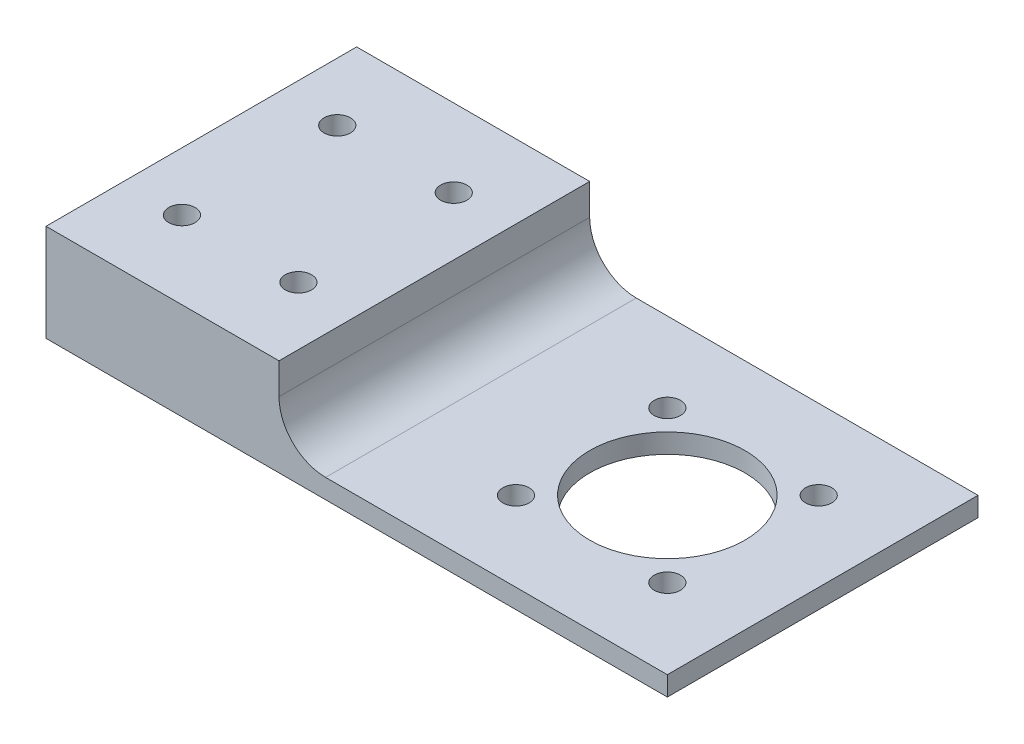
ISO-10303-21;
HEADER;
FILE_DESCRIPTION(('STEP AP214'),'2;1');
FILE_NAME('part.step','',(''),(''),'','','');
FILE_SCHEMA(('AUTOMOTIVE_DESIGN { 1 0 10303 214 1 1 1 1 }'));
ENDSEC;
DATA;
#1=APPLICATION_CONTEXT('core data for automotive mechanical design processes');
#2=APPLICATION_PROTOCOL_DEFINITION('international standard','automotive_design',2000,#1);
#3=PRODUCT_CONTEXT('',#1,'mechanical');
#4=PRODUCT('Part','Part','',(#3));
#5=PRODUCT_RELATED_PRODUCT_CATEGORY('part','',(#4));
#6=PRODUCT_DEFINITION_FORMATION('','',#4);
#7=PRODUCT_DEFINITION_CONTEXT('part definition',#1,'design');
#8=PRODUCT_DEFINITION('design','',#6,#7);
#9=PRODUCT_DEFINITION_SHAPE('','',#8);
#10=(LENGTH_UNIT() NAMED_UNIT(*) SI_UNIT(.MILLI.,.METRE.));
#11=(NAMED_UNIT(*) PLANE_ANGLE_UNIT() SI_UNIT($,.RADIAN.));
#12=(NAMED_UNIT(*) SI_UNIT($,.STERADIAN.) SOLID_ANGLE_UNIT());
#13=UNCERTAINTY_MEASURE_WITH_UNIT(LENGTH_MEASURE(1.E-05),#10,'distance_accuracy_value','');
#14=(GEOMETRIC_REPRESENTATION_CONTEXT(3) GLOBAL_UNCERTAINTY_ASSIGNED_CONTEXT((#13)) GLOBAL_UNIT_ASSIGNED_CONTEXT((#10,
#11,#12)) REPRESENTATION_CONTEXT('',''));
#15=CARTESIAN_POINT('',(0.,0.,0.));
#16=DIRECTION('',(0.,0.,1.));
#17=DIRECTION('',(1.,0.,0.));
#18=AXIS2_PLACEMENT_3D('',#15,#16,#17);
#19=CARTESIAN_POINT('',(0.,3.175,0.));
#20=DIRECTION('',(0.,-1.,0.));
#21=DIRECTION('',(0.,0.,-1.));
#22=AXIS2_PLACEMENT_3D('',#19,#20,#21);
#23=PLANE('',#22);
#24=CARTESIAN_POINT('',(38.1,3.175,0.));
#25=DIRECTION('',(0.,1.,0.));
#26=DIRECTION('',(0.,0.,1.));
#27=AXIS2_PLACEMENT_3D('',#24,#25,#26);
#28=CIRCLE('',#27,12.7);
#29=CARTESIAN_POINT('',(38.1,3.175,12.7));
#30=VERTEX_POINT('',#29);
#31=EDGE_CURVE('E316',#30,#30,#28,.T.);
#32=ORIENTED_EDGE('',*,*,#31,.F.);
#33=EDGE_LOOP('',(#32));
#34=FACE_BOUND('',#33,.T.);
#35=CARTESIAN_POINT('',(50.4743686707638,3.175,-12.3743686707636));
#36=DIRECTION('',(0.,1.,0.));
#37=DIRECTION('',(0.,0.,1.));
#38=AXIS2_PLACEMENT_3D('',#35,#36,#37);
#39=CIRCLE('',#38,2.15265);
#40=CARTESIAN_POINT('',(50.4743686707638,3.175,-10.2217186707636));
#41=VERTEX_POINT('',#40);
#42=EDGE_CURVE('E294',#41,#41,#39,.T.);
#43=ORIENTED_EDGE('',*,*,#42,.F.);
#44=EDGE_LOOP('',(#43));
#45=FACE_BOUND('',#44,.T.);
#46=CARTESIAN_POINT('',(25.7256313292346,3.175,12.3743686707654));
#47=DIRECTION('',(0.,1.,0.));
#48=DIRECTION('',(0.,0.,1.));
#49=AXIS2_PLACEMENT_3D('',#46,#47,#48);
#50=CIRCLE('',#49,2.15265);
#51=CARTESIAN_POINT('',(25.7256313292346,3.175,14.5270186707654));
#52=VERTEX_POINT('',#51);
#53=EDGE_CURVE('E289',#52,#52,#50,.T.);
#54=ORIENTED_EDGE('',*,*,#53,.F.);
#55=EDGE_LOOP('',(#54));
#56=FACE_BOUND('',#55,.T.);
#57=CARTESIAN_POINT('',(25.7256313292344,3.175,-12.3743686707635));
#58=DIRECTION('',(0.,1.,0.));
#59=DIRECTION('',(0.,0.,1.));
#60=AXIS2_PLACEMENT_3D('',#57,#58,#59);
#61=CIRCLE('',#60,2.15265);
#62=CARTESIAN_POINT('',(25.7256313292344,3.175,-10.2217186707635));
#63=VERTEX_POINT('',#62);
#64=EDGE_CURVE('E310',#63,#63,#61,.T.);
#65=ORIENTED_EDGE('',*,*,#64,.F.);
#66=EDGE_LOOP('',(#65));
#67=FACE_BOUND('',#66,.T.);
#68=CARTESIAN_POINT('',(50.4743686707642,3.175,12.374368670765));
#69=DIRECTION('',(0.,1.,0.));
#70=DIRECTION('',(0.,0.,1.));
#71=AXIS2_PLACEMENT_3D('',#68,#69,#70);
#72=CIRCLE('',#71,2.15265);
#73=CARTESIAN_POINT('',(50.4743686707642,3.175,14.527018670765));
#74=VERTEX_POINT('',#73);
#75=EDGE_CURVE('E118',#74,#74,#72,.T.);
#76=ORIENTED_EDGE('',*,*,#75,.F.);
#77=EDGE_LOOP('',(#76));
#78=FACE_BOUND('',#77,.T.);
#79=DIRECTION('',(-1.,0.,0.));
#80=VECTOR('',#79,1.);
#81=CARTESIAN_POINT('',(-38.1,3.175,-25.4));
#82=LINE('',#81,#80);
#83=CARTESIAN_POINT('',(63.5,3.175,-25.4));
#84=VERTEX_POINT('',#83);
#85=CARTESIAN_POINT('',(7.61999999999999,3.175,-25.4));
#86=VERTEX_POINT('',#85);
#87=EDGE_CURVE('E127',#84,#86,#82,.T.);
#88=ORIENTED_EDGE('',*,*,#87,.T.);
#89=DIRECTION('',(0.,0.,-1.));
#90=VECTOR('',#89,1.);
#91=CARTESIAN_POINT('',(7.62,3.175,25.4));
#92=LINE('',#91,#90);
#93=CARTESIAN_POINT('',(7.62,3.175,25.4));
#94=VERTEX_POINT('',#93);
#95=EDGE_CURVE('E53',#86,#94,#92,.F.);
#96=ORIENTED_EDGE('',*,*,#95,.T.);
#97=DIRECTION('',(1.,0.,0.));
#98=VECTOR('',#97,1.);
#99=CARTESIAN_POINT('',(-38.1,3.175,25.4));
#100=LINE('',#99,#98);
#101=CARTESIAN_POINT('',(63.5,3.175,25.4));
#102=VERTEX_POINT('',#101);
#103=EDGE_CURVE('E129',#94,#102,#100,.T.);
#104=ORIENTED_EDGE('',*,*,#103,.T.);
#105=DIRECTION('',(0.,0.,-1.));
#106=VECTOR('',#105,1.);
#107=CARTESIAN_POINT('',(63.5,3.175,-25.4));
#108=LINE('',#107,#106);
#109=EDGE_CURVE('E132',#102,#84,#108,.T.);
#110=ORIENTED_EDGE('',*,*,#109,.T.);
#111=EDGE_LOOP('',(#88,#96,#104,#110));
#112=FACE_BOUND('',#111,.T.);
#113=ADVANCED_FACE('F32',(#34,#45,#56,#67,#78,#112),#23,.F.);
#114=CARTESIAN_POINT('',(-38.1,3.175,-25.4));
#115=DIRECTION('',(1.,0.,0.));
#116=DIRECTION('',(0.,0.,-1.));
#117=AXIS2_PLACEMENT_3D('',#114,#115,#116);
#118=PLANE('',#117);
#119=DIRECTION('',(0.,0.,1.));
#120=VECTOR('',#119,1.);
#121=CARTESIAN_POINT('',(-38.1,0.,-25.4));
#122=LINE('',#121,#120);
#123=CARTESIAN_POINT('',(-38.1,0.,-25.4));
#124=VERTEX_POINT('',#123);
#125=CARTESIAN_POINT('',(-38.1,0.,25.4));
#126=VERTEX_POINT('',#125);
#127=EDGE_CURVE('E97',#124,#126,#122,.T.);
#128=ORIENTED_EDGE('',*,*,#127,.T.);
#129=DIRECTION('',(0.,-1.,0.));
#130=VECTOR('',#129,1.);
#131=CARTESIAN_POINT('',(-38.1,3.175,25.4));
#132=LINE('',#131,#130);
#133=CARTESIAN_POINT('',(-38.1,15.875,25.4));
#134=VERTEX_POINT('',#133);
#135=EDGE_CURVE('E90',#134,#126,#132,.T.);
#136=ORIENTED_EDGE('',*,*,#135,.F.);
#137=DIRECTION('',(0.,0.,1.));
#138=VECTOR('',#137,1.);
#139=CARTESIAN_POINT('',(-38.1,15.875,-25.4));
#140=LINE('',#139,#138);
#141=CARTESIAN_POINT('',(-38.1,15.875,-25.4));
#142=VERTEX_POINT('',#141);
#143=EDGE_CURVE('E95',#142,#134,#140,.T.);
#144=ORIENTED_EDGE('',*,*,#143,.F.);
#145=DIRECTION('',(0.,-1.,0.));
#146=VECTOR('',#145,1.);
#147=CARTESIAN_POINT('',(-38.1,3.175,-25.4));
#148=LINE('',#147,#146);
#149=EDGE_CURVE('E99',#142,#124,#148,.T.);
#150=ORIENTED_EDGE('',*,*,#149,.T.);
#151=EDGE_LOOP('',(#128,#136,#144,#150));
#152=FACE_BOUND('',#151,.T.);
#153=ADVANCED_FACE('F92',(#152),#118,.F.);
#154=CARTESIAN_POINT('',(63.5,3.175,25.4));
#155=DIRECTION('',(0.,0.,-1.));
#156=DIRECTION('',(-1.,0.,0.));
#157=AXIS2_PLACEMENT_3D('',#154,#155,#156);
#158=PLANE('',#157);
#159=DIRECTION('',(1.,0.,0.));
#160=VECTOR('',#159,1.);
#161=CARTESIAN_POINT('',(63.5,0.,25.4));
#162=LINE('',#161,#160);
#163=CARTESIAN_POINT('',(63.5,0.,25.4));
#164=VERTEX_POINT('',#163);
#165=EDGE_CURVE('E137',#126,#164,#162,.T.);
#166=ORIENTED_EDGE('',*,*,#165,.T.);
#167=DIRECTION('',(0.,-1.,0.));
#168=VECTOR('',#167,1.);
#169=CARTESIAN_POINT('',(63.5,3.175,25.4));
#170=LINE('',#169,#168);
#171=EDGE_CURVE('E100',#102,#164,#170,.T.);
#172=ORIENTED_EDGE('',*,*,#171,.F.);
#173=ORIENTED_EDGE('',*,*,#103,.F.);
#174=CARTESIAN_POINT('',(7.62,10.795,25.4));
#175=DIRECTION('',(0.,0.,-1.));
#176=DIRECTION('',(-1.,0.,0.));
#177=AXIS2_PLACEMENT_3D('',#174,#175,#176);
#178=CIRCLE('',#177,7.62);
#179=CARTESIAN_POINT('',(0.,10.795,25.4));
#180=VERTEX_POINT('',#179);
#181=EDGE_CURVE('E11',#94,#180,#178,.T.);
#182=ORIENTED_EDGE('',*,*,#181,.T.);
#183=DIRECTION('',(0.,-1.,0.));
#184=VECTOR('',#183,1.);
#185=CARTESIAN_POINT('',(0.,15.875,25.4));
#186=LINE('',#185,#184);
#187=CARTESIAN_POINT('',(0.,15.875,25.4));
#188=VERTEX_POINT('',#187);
#189=EDGE_CURVE('E106',#188,#180,#186,.T.);
#190=ORIENTED_EDGE('',*,*,#189,.F.);
#191=DIRECTION('',(1.,0.,0.));
#192=VECTOR('',#191,1.);
#193=CARTESIAN_POINT('',(-38.1,15.875,25.4));
#194=LINE('',#193,#192);
#195=EDGE_CURVE('E103',#134,#188,#194,.T.);
#196=ORIENTED_EDGE('',*,*,#195,.F.);
#197=ORIENTED_EDGE('',*,*,#135,.T.);
#198=EDGE_LOOP('',(#166,#172,#173,#182,#190,#196,#197));
#199=FACE_BOUND('',#198,.T.);
#200=ADVANCED_FACE('F104',(#199),#158,.F.);
#201=CARTESIAN_POINT('',(63.5,3.175,-25.4));
#202=DIRECTION('',(-1.,0.,0.));
#203=DIRECTION('',(0.,0.,1.));
#204=AXIS2_PLACEMENT_3D('',#201,#202,#203);
#205=PLANE('',#204);
#206=DIRECTION('',(0.,0.,-1.));
#207=VECTOR('',#206,1.);
#208=CARTESIAN_POINT('',(63.5,0.,-25.4));
#209=LINE('',#208,#207);
#210=CARTESIAN_POINT('',(63.5,0.,-25.4));
#211=VERTEX_POINT('',#210);
#212=EDGE_CURVE('E139',#164,#211,#209,.T.);
#213=ORIENTED_EDGE('',*,*,#212,.T.);
#214=DIRECTION('',(0.,-1.,0.));
#215=VECTOR('',#214,1.);
#216=CARTESIAN_POINT('',(63.5,3.175,-25.4));
#217=LINE('',#216,#215);
#218=EDGE_CURVE('E135',#84,#211,#217,.T.);
#219=ORIENTED_EDGE('',*,*,#218,.F.);
#220=ORIENTED_EDGE('',*,*,#109,.F.);
#221=ORIENTED_EDGE('',*,*,#171,.T.);
#222=EDGE_LOOP('',(#213,#219,#220,#221));
#223=FACE_BOUND('',#222,.T.);
#224=ADVANCED_FACE('F165',(#223),#205,.F.);
#225=CARTESIAN_POINT('',(50.8,3.175,-25.4));
#226=DIRECTION('',(0.,0.,1.));
#227=DIRECTION('',(1.,0.,0.));
#228=AXIS2_PLACEMENT_3D('',#225,#226,#227);
#229=PLANE('',#228);
#230=DIRECTION('',(-1.,0.,0.));
#231=VECTOR('',#230,1.);
#232=CARTESIAN_POINT('',(50.8,0.,-25.4));
#233=LINE('',#232,#231);
#234=EDGE_CURVE('E130',#211,#124,#233,.T.);
#235=ORIENTED_EDGE('',*,*,#234,.T.);
#236=ORIENTED_EDGE('',*,*,#149,.F.);
#237=DIRECTION('',(-1.,0.,0.));
#238=VECTOR('',#237,1.);
#239=CARTESIAN_POINT('',(-38.1,15.875,-25.4));
#240=LINE('',#239,#238);
#241=CARTESIAN_POINT('',(0.,15.875,-25.4));
#242=VERTEX_POINT('',#241);
#243=EDGE_CURVE('E114',#242,#142,#240,.T.);
#244=ORIENTED_EDGE('',*,*,#243,.F.);
#245=DIRECTION('',(0.,-1.,0.));
#246=VECTOR('',#245,1.);
#247=CARTESIAN_POINT('',(0.,15.875,-25.4));
#248=LINE('',#247,#246);
#249=CARTESIAN_POINT('',(0.,10.795,-25.4));
#250=VERTEX_POINT('',#249);
#251=EDGE_CURVE('E124',#242,#250,#248,.T.);
#252=ORIENTED_EDGE('',*,*,#251,.T.);
#253=CARTESIAN_POINT('',(7.62,10.795,-25.4));
#254=DIRECTION('',(0.,0.,1.));
#255=DIRECTION('',(1.,0.,0.));
#256=AXIS2_PLACEMENT_3D('',#253,#254,#255);
#257=CIRCLE('',#256,7.62);
#258=EDGE_CURVE('E40',#250,#86,#257,.T.);
#259=ORIENTED_EDGE('',*,*,#258,.T.);
#260=ORIENTED_EDGE('',*,*,#87,.F.);
#261=ORIENTED_EDGE('',*,*,#218,.T.);
#262=EDGE_LOOP('',(#235,#236,#244,#252,#259,#260,#261));
#263=FACE_BOUND('',#262,.T.);
#264=ADVANCED_FACE('F157',(#263),#229,.F.);
#265=CARTESIAN_POINT('',(0.,0.,0.));
#266=DIRECTION('',(0.,-1.,0.));
#267=DIRECTION('',(0.,0.,-1.));
#268=AXIS2_PLACEMENT_3D('',#265,#266,#267);
#269=PLANE('',#268);
#270=CARTESIAN_POINT('',(-28.575,0.,-12.7));
#271=DIRECTION('',(0.,-1.,0.));
#272=DIRECTION('',(0.,0.,1.));
#273=AXIS2_PLACEMENT_3D('',#270,#271,#272);
#274=CIRCLE('',#273,2.15265);
#275=CARTESIAN_POINT('',(-28.575,0.,-10.54735));
#276=VERTEX_POINT('',#275);
#277=EDGE_CURVE('E329',#276,#276,#274,.T.);
#278=ORIENTED_EDGE('',*,*,#277,.F.);
#279=EDGE_LOOP('',(#278));
#280=FACE_BOUND('',#279,.T.);
#281=CARTESIAN_POINT('',(-9.525,0.,12.7));
#282=DIRECTION('',(0.,-1.,0.));
#283=DIRECTION('',(0.,0.,-1.));
#284=AXIS2_PLACEMENT_3D('',#281,#282,#283);
#285=CIRCLE('',#284,2.15265);
#286=CARTESIAN_POINT('',(-9.525,0.,10.54735));
#287=VERTEX_POINT('',#286);
#288=EDGE_CURVE('E330',#287,#287,#285,.T.);
#289=ORIENTED_EDGE('',*,*,#288,.F.);
#290=EDGE_LOOP('',(#289));
#291=FACE_BOUND('',#290,.T.);
#292=CARTESIAN_POINT('',(-28.575,0.,12.7));
#293=DIRECTION('',(0.,-1.,0.));
#294=DIRECTION('',(0.,0.,-1.));
#295=AXIS2_PLACEMENT_3D('',#292,#293,#294);
#296=CIRCLE('',#295,2.15265);
#297=CARTESIAN_POINT('',(-28.575,0.,10.54735));
#298=VERTEX_POINT('',#297);
#299=EDGE_CURVE('E339',#298,#298,#296,.T.);
#300=ORIENTED_EDGE('',*,*,#299,.F.);
#301=EDGE_LOOP('',(#300));
#302=FACE_BOUND('',#301,.T.);
#303=CARTESIAN_POINT('',(-9.525,0.,-12.7));
#304=DIRECTION('',(0.,-1.,0.));
#305=DIRECTION('',(0.,0.,1.));
#306=AXIS2_PLACEMENT_3D('',#303,#304,#305);
#307=CIRCLE('',#306,2.15265);
#308=CARTESIAN_POINT('',(-9.525,0.,-10.54735));
#309=VERTEX_POINT('',#308);
#310=EDGE_CURVE('E322',#309,#309,#307,.T.);
#311=ORIENTED_EDGE('',*,*,#310,.F.);
#312=EDGE_LOOP('',(#311));
#313=FACE_BOUND('',#312,.T.);
#314=CARTESIAN_POINT('',(38.1,0.,0.));
#315=DIRECTION('',(0.,-1.,0.));
#316=DIRECTION('',(0.,0.,-1.));
#317=AXIS2_PLACEMENT_3D('',#314,#315,#316);
#318=CIRCLE('',#317,12.7);
#319=CARTESIAN_POINT('',(38.1,0.,-12.7));
#320=VERTEX_POINT('',#319);
#321=EDGE_CURVE('E313',#320,#320,#318,.F.);
#322=ORIENTED_EDGE('',*,*,#321,.T.);
#323=EDGE_LOOP('',(#322));
#324=FACE_BOUND('',#323,.T.);
#325=CARTESIAN_POINT('',(50.4743686707638,0.,-12.3743686707636));
#326=DIRECTION('',(0.,-1.,0.));
#327=DIRECTION('',(0.,0.,-1.));
#328=AXIS2_PLACEMENT_3D('',#325,#326,#327);
#329=CIRCLE('',#328,2.15265);
#330=CARTESIAN_POINT('',(50.4743686707638,0.,-14.5270186707636));
#331=VERTEX_POINT('',#330);
#332=EDGE_CURVE('E297',#331,#331,#329,.F.);
#333=ORIENTED_EDGE('',*,*,#332,.T.);
#334=EDGE_LOOP('',(#333));
#335=FACE_BOUND('',#334,.T.);
#336=CARTESIAN_POINT('',(25.7256313292346,0.,12.3743686707654));
#337=DIRECTION('',(0.,-1.,0.));
#338=DIRECTION('',(0.,0.,-1.));
#339=AXIS2_PLACEMENT_3D('',#336,#337,#338);
#340=CIRCLE('',#339,2.15265);
#341=CARTESIAN_POINT('',(25.7256313292346,0.,10.2217186707654));
#342=VERTEX_POINT('',#341);
#343=EDGE_CURVE('E292',#342,#342,#340,.F.);
#344=ORIENTED_EDGE('',*,*,#343,.T.);
#345=EDGE_LOOP('',(#344));
#346=FACE_BOUND('',#345,.T.);
#347=CARTESIAN_POINT('',(25.7256313292344,0.,-12.3743686707635));
#348=DIRECTION('',(0.,-1.,0.));
#349=DIRECTION('',(0.,0.,-1.));
#350=AXIS2_PLACEMENT_3D('',#347,#348,#349);
#351=CIRCLE('',#350,2.15265);
#352=CARTESIAN_POINT('',(25.7256313292344,0.,-14.5270186707635));
#353=VERTEX_POINT('',#352);
#354=EDGE_CURVE('E299',#353,#353,#351,.F.);
#355=ORIENTED_EDGE('',*,*,#354,.T.);
#356=EDGE_LOOP('',(#355));
#357=FACE_BOUND('',#356,.T.);
#358=CARTESIAN_POINT('',(50.4743686707642,0.,12.374368670765));
#359=DIRECTION('',(0.,-1.,0.));
#360=DIRECTION('',(0.,0.,-1.));
#361=AXIS2_PLACEMENT_3D('',#358,#359,#360);
#362=CIRCLE('',#361,2.15265);
#363=CARTESIAN_POINT('',(50.4743686707642,0.,10.221718670765));
#364=VERTEX_POINT('',#363);
#365=EDGE_CURVE('E115',#364,#364,#362,.F.);
#366=ORIENTED_EDGE('',*,*,#365,.T.);
#367=EDGE_LOOP('',(#366));
#368=FACE_BOUND('',#367,.T.);
#369=ORIENTED_EDGE('',*,*,#127,.F.);
#370=ORIENTED_EDGE('',*,*,#234,.F.);
#371=ORIENTED_EDGE('',*,*,#212,.F.);
#372=ORIENTED_EDGE('',*,*,#165,.F.);
#373=EDGE_LOOP('',(#369,#370,#371,#372));
#374=FACE_BOUND('',#373,.T.);
#375=ADVANCED_FACE('F161',(#280,#291,#302,#313,#324,#335,#346,#357,#368,#374),#269,.T.);
#376=CARTESIAN_POINT('',(0.,15.875,-25.4));
#377=DIRECTION('',(-1.,0.,0.));
#378=DIRECTION('',(0.,0.,1.));
#379=AXIS2_PLACEMENT_3D('',#376,#377,#378);
#380=PLANE('',#379);
#381=ORIENTED_EDGE('',*,*,#189,.T.);
#382=DIRECTION('',(0.,0.,-1.));
#383=VECTOR('',#382,1.);
#384=CARTESIAN_POINT('',(0.,10.795,-25.4));
#385=LINE('',#384,#383);
#386=EDGE_CURVE('E148',#180,#250,#385,.T.);
#387=ORIENTED_EDGE('',*,*,#386,.T.);
#388=ORIENTED_EDGE('',*,*,#251,.F.);
#389=DIRECTION('',(0.,0.,-1.));
#390=VECTOR('',#389,1.);
#391=CARTESIAN_POINT('',(0.,15.875,-25.4));
#392=LINE('',#391,#390);
#393=EDGE_CURVE('E109',#188,#242,#392,.T.);
#394=ORIENTED_EDGE('',*,*,#393,.F.);
#395=EDGE_LOOP('',(#381,#387,#388,#394));
#396=FACE_BOUND('',#395,.T.);
#397=ADVANCED_FACE('F154',(#396),#380,.F.);
#398=CARTESIAN_POINT('',(0.,15.875,0.));
#399=DIRECTION('',(0.,1.,0.));
#400=DIRECTION('',(0.,0.,1.));
#401=AXIS2_PLACEMENT_3D('',#398,#399,#400);
#402=PLANE('',#401);
#403=CARTESIAN_POINT('',(-28.575,15.875,-12.7));
#404=DIRECTION('',(0.,1.,0.));
#405=DIRECTION('',(0.,0.,1.));
#406=AXIS2_PLACEMENT_3D('',#403,#404,#405);
#407=CIRCLE('',#406,2.15265);
#408=CARTESIAN_POINT('',(-28.575,15.875,-10.54735));
#409=VERTEX_POINT('',#408);
#410=EDGE_CURVE('E325',#409,#409,#407,.F.);
#411=ORIENTED_EDGE('',*,*,#410,.T.);
#412=EDGE_LOOP('',(#411));
#413=FACE_BOUND('',#412,.T.);
#414=CARTESIAN_POINT('',(-9.525,15.875,12.7));
#415=DIRECTION('',(0.,1.,0.));
#416=DIRECTION('',(0.,0.,1.));
#417=AXIS2_PLACEMENT_3D('',#414,#415,#416);
#418=CIRCLE('',#417,2.15265);
#419=CARTESIAN_POINT('',(-9.525,15.875,14.85265));
#420=VERTEX_POINT('',#419);
#421=EDGE_CURVE('E326',#420,#420,#418,.F.);
#422=ORIENTED_EDGE('',*,*,#421,.T.);
#423=EDGE_LOOP('',(#422));
#424=FACE_BOUND('',#423,.T.);
#425=CARTESIAN_POINT('',(-28.575,15.875,12.7));
#426=DIRECTION('',(0.,1.,0.));
#427=DIRECTION('',(0.,0.,1.));
#428=AXIS2_PLACEMENT_3D('',#425,#426,#427);
#429=CIRCLE('',#428,2.15265);
#430=CARTESIAN_POINT('',(-28.575,15.875,14.85265));
#431=VERTEX_POINT('',#430);
#432=EDGE_CURVE('E333',#431,#431,#429,.F.);
#433=ORIENTED_EDGE('',*,*,#432,.T.);
#434=EDGE_LOOP('',(#433));
#435=FACE_BOUND('',#434,.T.);
#436=CARTESIAN_POINT('',(-9.525,15.875,-12.7));
#437=DIRECTION('',(0.,1.,0.));
#438=DIRECTION('',(0.,0.,1.));
#439=AXIS2_PLACEMENT_3D('',#436,#437,#438);
#440=CIRCLE('',#439,2.15265);
#441=CARTESIAN_POINT('',(-9.525,15.875,-10.54735));
#442=VERTEX_POINT('',#441);
#443=EDGE_CURVE('E319',#442,#442,#440,.F.);
#444=ORIENTED_EDGE('',*,*,#443,.T.);
#445=EDGE_LOOP('',(#444));
#446=FACE_BOUND('',#445,.T.);
#447=ORIENTED_EDGE('',*,*,#143,.T.);
#448=ORIENTED_EDGE('',*,*,#195,.T.);
#449=ORIENTED_EDGE('',*,*,#393,.T.);
#450=ORIENTED_EDGE('',*,*,#243,.T.);
#451=EDGE_LOOP('',(#447,#448,#449,#450));
#452=FACE_BOUND('',#451,.T.);
#453=ADVANCED_FACE('F112',(#413,#424,#435,#446,#452),#402,.T.);
#454=CARTESIAN_POINT('',(7.62,10.795,-25.4));
#455=DIRECTION('',(0.,0.,1.));
#456=DIRECTION('',(1.,0.,0.));
#457=AXIS2_PLACEMENT_3D('',#454,#455,#456);
#458=CYLINDRICAL_SURFACE('',#457,7.62);
#459=ORIENTED_EDGE('',*,*,#181,.F.);
#460=ORIENTED_EDGE('',*,*,#95,.F.);
#461=ORIENTED_EDGE('',*,*,#258,.F.);
#462=ORIENTED_EDGE('',*,*,#386,.F.);
#463=EDGE_LOOP('',(#459,#460,#461,#462));
#464=FACE_BOUND('',#463,.T.);
#465=ADVANCED_FACE('F34',(#464),#458,.F.);
#466=CARTESIAN_POINT('',(50.4743686707642,-6.08861365008489,12.374368670765));
#467=DIRECTION('',(0.,1.,0.));
#468=DIRECTION('',(0.,0.,1.));
#469=AXIS2_PLACEMENT_3D('',#466,#467,#468);
#470=CYLINDRICAL_SURFACE('',#469,2.15265);
#471=ORIENTED_EDGE('',*,*,#75,.T.);
#472=EDGE_LOOP('',(#471));
#473=FACE_BOUND('',#472,.T.);
#474=ORIENTED_EDGE('',*,*,#365,.F.);
#475=EDGE_LOOP('',(#474));
#476=FACE_BOUND('',#475,.T.);
#477=ADVANCED_FACE('F167',(#473,#476),#470,.F.);
#478=CARTESIAN_POINT('',(25.7256313292344,-6.08861365008489,-12.3743686707635));
#479=DIRECTION('',(0.,1.,0.));
#480=DIRECTION('',(0.,0.,1.));
#481=AXIS2_PLACEMENT_3D('',#478,#479,#480);
#482=CYLINDRICAL_SURFACE('',#481,2.15265);
#483=ORIENTED_EDGE('',*,*,#64,.T.);
#484=EDGE_LOOP('',(#483));
#485=FACE_BOUND('',#484,.T.);
#486=ORIENTED_EDGE('',*,*,#354,.F.);
#487=EDGE_LOOP('',(#486));
#488=FACE_BOUND('',#487,.T.);
#489=ADVANCED_FACE('F172',(#485,#488),#482,.F.);
#490=CARTESIAN_POINT('',(25.7256313292346,-6.08861365008489,12.3743686707654));
#491=DIRECTION('',(0.,1.,0.));
#492=DIRECTION('',(0.,0.,1.));
#493=AXIS2_PLACEMENT_3D('',#490,#491,#492);
#494=CYLINDRICAL_SURFACE('',#493,2.15265);
#495=ORIENTED_EDGE('',*,*,#53,.T.);
#496=EDGE_LOOP('',(#495));
#497=FACE_BOUND('',#496,.T.);
#498=ORIENTED_EDGE('',*,*,#343,.F.);
#499=EDGE_LOOP('',(#498));
#500=FACE_BOUND('',#499,.T.);
#501=ADVANCED_FACE('F277',(#497,#500),#494,.F.);
#502=CARTESIAN_POINT('',(50.4743686707638,-6.08861365008489,-12.3743686707636));
#503=DIRECTION('',(0.,1.,0.));
#504=DIRECTION('',(0.,0.,1.));
#505=AXIS2_PLACEMENT_3D('',#502,#503,#504);
#506=CYLINDRICAL_SURFACE('',#505,2.15265);
#507=ORIENTED_EDGE('',*,*,#42,.T.);
#508=EDGE_LOOP('',(#507));
#509=FACE_BOUND('',#508,.T.);
#510=ORIENTED_EDGE('',*,*,#332,.F.);
#511=EDGE_LOOP('',(#510));
#512=FACE_BOUND('',#511,.T.);
#513=ADVANCED_FACE('F273',(#509,#512),#506,.F.);
#514=CARTESIAN_POINT('',(38.1,-35.9210244842766,0.));
#515=DIRECTION('',(0.,1.,0.));
#516=DIRECTION('',(0.,0.,1.));
#517=AXIS2_PLACEMENT_3D('',#514,#515,#516);
#518=CYLINDRICAL_SURFACE('',#517,12.7);
#519=ORIENTED_EDGE('',*,*,#31,.T.);
#520=EDGE_LOOP('',(#519));
#521=FACE_BOUND('',#520,.T.);
#522=ORIENTED_EDGE('',*,*,#321,.F.);
#523=EDGE_LOOP('',(#522));
#524=FACE_BOUND('',#523,.T.);
#525=ADVANCED_FACE('F233',(#521,#524),#518,.F.);
#526=CARTESIAN_POINT('',(-9.525,21.9636136500849,-12.7));
#527=DIRECTION('',(0.,-1.,0.));
#528=DIRECTION('',(0.,0.,-1.));
#529=AXIS2_PLACEMENT_3D('',#526,#527,#528);
#530=CYLINDRICAL_SURFACE('',#529,2.15265);
#531=ORIENTED_EDGE('',*,*,#310,.T.);
#532=EDGE_LOOP('',(#531));
#533=FACE_BOUND('',#532,.T.);
#534=ORIENTED_EDGE('',*,*,#443,.F.);
#535=EDGE_LOOP('',(#534));
#536=FACE_BOUND('',#535,.T.);
#537=ADVANCED_FACE('F227',(#533,#536),#530,.F.);
#538=CARTESIAN_POINT('',(-28.575,21.9636136500849,12.7));
#539=DIRECTION('',(0.,-1.,0.));
#540=DIRECTION('',(0.,0.,-1.));
#541=AXIS2_PLACEMENT_3D('',#538,#539,#540);
#542=CYLINDRICAL_SURFACE('',#541,2.15265);
#543=ORIENTED_EDGE('',*,*,#299,.T.);
#544=EDGE_LOOP('',(#543));
#545=FACE_BOUND('',#544,.T.);
#546=ORIENTED_EDGE('',*,*,#432,.F.);
#547=EDGE_LOOP('',(#546));
#548=FACE_BOUND('',#547,.T.);
#549=ADVANCED_FACE('F232',(#545,#548),#542,.F.);
#550=CARTESIAN_POINT('',(-9.525,21.9636136500849,12.7));
#551=DIRECTION('',(0.,-1.,0.));
#552=DIRECTION('',(0.,0.,-1.));
#553=AXIS2_PLACEMENT_3D('',#550,#551,#552);
#554=CYLINDRICAL_SURFACE('',#553,2.15265);
#555=ORIENTED_EDGE('',*,*,#288,.T.);
#556=EDGE_LOOP('',(#555));
#557=FACE_BOUND('',#556,.T.);
#558=ORIENTED_EDGE('',*,*,#421,.F.);
#559=EDGE_LOOP('',(#558));
#560=FACE_BOUND('',#559,.T.);
#561=ADVANCED_FACE('F245',(#557,#560),#554,.F.);
#562=CARTESIAN_POINT('',(-28.575,21.9636136500849,-12.7));
#563=DIRECTION('',(0.,-1.,0.));
#564=DIRECTION('',(0.,0.,-1.));
#565=AXIS2_PLACEMENT_3D('',#562,#563,#564);
#566=CYLINDRICAL_SURFACE('',#565,2.15265);
#567=ORIENTED_EDGE('',*,*,#277,.T.);
#568=EDGE_LOOP('',(#567));
#569=FACE_BOUND('',#568,.T.);
#570=ORIENTED_EDGE('',*,*,#410,.F.);
#571=EDGE_LOOP('',(#570));
#572=FACE_BOUND('',#571,.T.);
#573=ADVANCED_FACE('F255',(#569,#572),#566,.F.);
#574=CLOSED_SHELL('',(#113,#153,#200,#224,#264,#375,#397,#453,#465,#477,#489,#501,#513,#525,
#537,#549,#561,#573));
#575=MANIFOLD_SOLID_BREP('B2',#574);
#576=ADVANCED_BREP_SHAPE_REPRESENTATION('',(#18,#575),#14);
#577=SHAPE_DEFINITION_REPRESENTATION(#9,#576);
ENDSEC;
END-ISO-10303-21;
